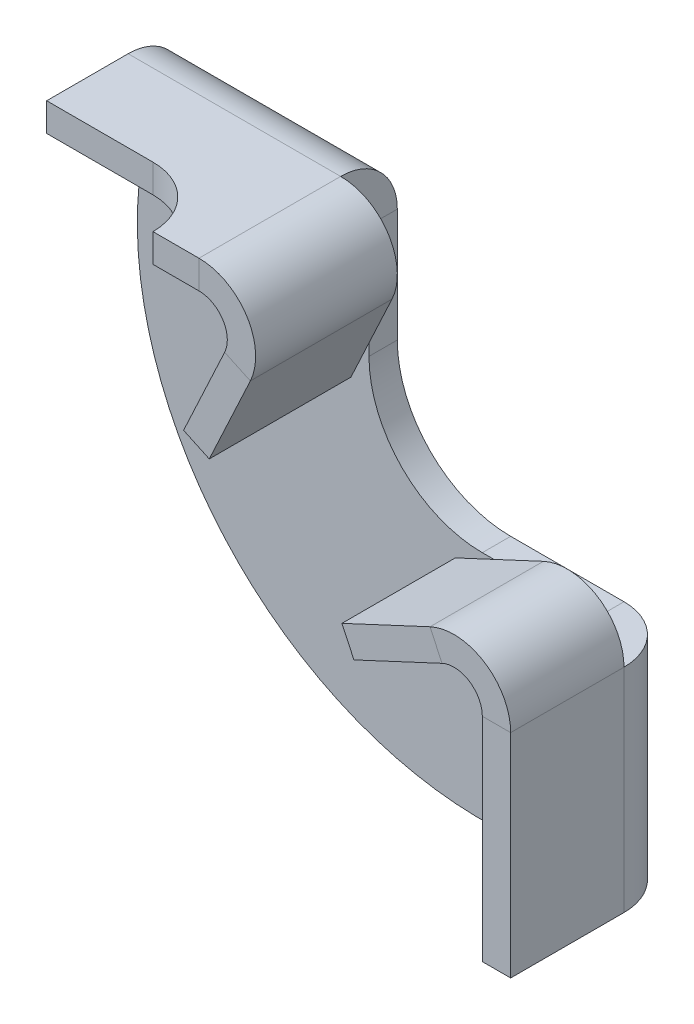
ISO-10303-21;
HEADER;
FILE_DESCRIPTION(('STEP AP214'),'2;1');
FILE_NAME('part.step','',(''),(''),'','','');
FILE_SCHEMA(('AUTOMOTIVE_DESIGN { 1 0 10303 214 1 1 1 1 }'));
ENDSEC;
DATA;
#1=APPLICATION_CONTEXT('core data for automotive mechanical design processes');
#2=APPLICATION_PROTOCOL_DEFINITION('international standard','automotive_design',2000,#1);
#3=PRODUCT_CONTEXT('',#1,'mechanical');
#4=PRODUCT('Part','Part','',(#3));
#5=PRODUCT_RELATED_PRODUCT_CATEGORY('part','',(#4));
#6=PRODUCT_DEFINITION_FORMATION('','',#4);
#7=PRODUCT_DEFINITION_CONTEXT('part definition',#1,'design');
#8=PRODUCT_DEFINITION('design','',#6,#7);
#9=PRODUCT_DEFINITION_SHAPE('','',#8);
#10=(LENGTH_UNIT() NAMED_UNIT(*) SI_UNIT(.MILLI.,.METRE.));
#11=(NAMED_UNIT(*) PLANE_ANGLE_UNIT() SI_UNIT($,.RADIAN.));
#12=(NAMED_UNIT(*) SI_UNIT($,.STERADIAN.) SOLID_ANGLE_UNIT());
#13=UNCERTAINTY_MEASURE_WITH_UNIT(LENGTH_MEASURE(1.E-05),#10,'distance_accuracy_value','');
#14=(GEOMETRIC_REPRESENTATION_CONTEXT(3) GLOBAL_UNCERTAINTY_ASSIGNED_CONTEXT((#13)) GLOBAL_UNIT_ASSIGNED_CONTEXT((#10,
#11,#12)) REPRESENTATION_CONTEXT('',''));
#15=CARTESIAN_POINT('',(0.,0.,0.));
#16=DIRECTION('',(0.,0.,1.));
#17=DIRECTION('',(1.,0.,0.));
#18=AXIS2_PLACEMENT_3D('',#15,#16,#17);
#19=CARTESIAN_POINT('',(-23.,11.9999999999999,1.99999999999999));
#20=DIRECTION('',(-1.,0.,0.));
#21=DIRECTION('',(0.,-1.,0.));
#22=AXIS2_PLACEMENT_3D('',#19,#20,#21);
#23=PLANE('',#22);
#24=DIRECTION('',(0.,0.,1.));
#25=VECTOR('',#24,1.);
#26=CARTESIAN_POINT('',(-23.,9.99999999999991,0.));
#27=LINE('',#26,#25);
#28=CARTESIAN_POINT('',(-23.,9.99999999999994,9.75000000000006));
#29=VERTEX_POINT('',#28);
#30=CARTESIAN_POINT('',(-23.,9.99999999999993,3.99999999999999));
#31=VERTEX_POINT('',#30);
#32=EDGE_CURVE('E1033',#29,#31,#27,.F.);
#33=ORIENTED_EDGE('',*,*,#32,.F.);
#34=DIRECTION('',(0.,1.,0.));
#35=VECTOR('',#34,1.);
#36=CARTESIAN_POINT('',(-23.,11.9999999999999,9.75000000000005));
#37=LINE('',#36,#35);
#38=CARTESIAN_POINT('',(-23.,11.9999999999999,9.75000000000005));
#39=VERTEX_POINT('',#38);
#40=EDGE_CURVE('E974',#39,#29,#37,.F.);
#41=ORIENTED_EDGE('',*,*,#40,.F.);
#42=DIRECTION('',(0.,0.,-1.));
#43=VECTOR('',#42,1.);
#44=CARTESIAN_POINT('',(-23.,11.9999999999999,1.99999999999999));
#45=LINE('',#44,#43);
#46=CARTESIAN_POINT('',(-23.,11.9999999999999,3.99999999999999));
#47=VERTEX_POINT('',#46);
#48=EDGE_CURVE('E393',#39,#47,#45,.T.);
#49=ORIENTED_EDGE('',*,*,#48,.T.);
#50=DIRECTION('',(0.,1.,0.));
#51=VECTOR('',#50,1.);
#52=CARTESIAN_POINT('',(-23.,9.99999999999992,3.99999999999999));
#53=LINE('',#52,#51);
#54=EDGE_CURVE('E376',#31,#47,#53,.T.);
#55=ORIENTED_EDGE('',*,*,#54,.F.);
#56=EDGE_LOOP('',(#33,#41,#49,#55));
#57=FACE_BOUND('',#56,.T.);
#58=ADVANCED_FACE('F125',(#57),#23,.T.);
#59=CARTESIAN_POINT('',(-23.,12.,14.0000000000001));
#60=DIRECTION('',(0.,0.,1.));
#61=DIRECTION('',(0.,-1.,0.));
#62=AXIS2_PLACEMENT_3D('',#59,#60,#61);
#63=PLANE('',#62);
#64=DIRECTION('',(-1.,0.,0.));
#65=VECTOR('',#64,1.);
#66=CARTESIAN_POINT('',(-23.,12.,14.0000000000001));
#67=LINE('',#66,#65);
#68=CARTESIAN_POINT('',(-8.00000000000001,12.,14.0000000000001));
#69=VERTEX_POINT('',#68);
#70=CARTESIAN_POINT('',(-11.25,12.,14.0000000000001));
#71=VERTEX_POINT('',#70);
#72=EDGE_CURVE('E1030',#69,#71,#67,.T.);
#73=ORIENTED_EDGE('',*,*,#72,.T.);
#74=DIRECTION('',(0.,1.,0.));
#75=VECTOR('',#74,1.);
#76=CARTESIAN_POINT('',(-11.25,12.,14.0000000000001));
#77=LINE('',#76,#75);
#78=CARTESIAN_POINT('',(-11.25,10.,14.0000000000001));
#79=VERTEX_POINT('',#78);
#80=EDGE_CURVE('E962',#71,#79,#77,.F.);
#81=ORIENTED_EDGE('',*,*,#80,.T.);
#82=DIRECTION('',(1.,0.,0.));
#83=VECTOR('',#82,1.);
#84=CARTESIAN_POINT('',(0.,10.,14.0000000000001));
#85=LINE('',#84,#83);
#86=CARTESIAN_POINT('',(-8.00000000000001,10.,14.0000000000001));
#87=VERTEX_POINT('',#86);
#88=EDGE_CURVE('E400',#87,#79,#85,.F.);
#89=ORIENTED_EDGE('',*,*,#88,.F.);
#90=DIRECTION('',(0.,-1.,0.));
#91=VECTOR('',#90,1.);
#92=CARTESIAN_POINT('',(-8.00000000000002,12.,14.0000000000001));
#93=LINE('',#92,#91);
#94=EDGE_CURVE('E232',#69,#87,#93,.T.);
#95=ORIENTED_EDGE('',*,*,#94,.F.);
#96=EDGE_LOOP('',(#73,#81,#89,#95));
#97=FACE_BOUND('',#96,.T.);
#98=ADVANCED_FACE('F519',(#97),#63,.T.);
#99=CARTESIAN_POINT('',(8.,-7.99999999999997,2.));
#100=DIRECTION('',(0.,-1.,0.));
#101=DIRECTION('',(1.,0.,0.));
#102=AXIS2_PLACEMENT_3D('',#99,#100,#101);
#103=PLANE('',#102);
#104=DIRECTION('',(-1.,0.,0.));
#105=VECTOR('',#104,1.);
#106=CARTESIAN_POINT('',(8.,-7.99999999999997,0.));
#107=LINE('',#106,#105);
#108=CARTESIAN_POINT('',(8.,-7.99999999999997,0.));
#109=VERTEX_POINT('',#108);
#110=CARTESIAN_POINT('',(0.,-7.99999999999999,0.));
#111=VERTEX_POINT('',#110);
#112=EDGE_CURVE('E342',#109,#111,#107,.T.);
#113=ORIENTED_EDGE('',*,*,#112,.T.);
#114=DIRECTION('',(0.,0.,-1.));
#115=VECTOR('',#114,1.);
#116=CARTESIAN_POINT('',(0.,-7.99999999999999,2.));
#117=LINE('',#116,#115);
#118=CARTESIAN_POINT('',(0.,-7.99999999999999,2.));
#119=VERTEX_POINT('',#118);
#120=EDGE_CURVE('E133',#119,#111,#117,.T.);
#121=ORIENTED_EDGE('',*,*,#120,.F.);
#122=DIRECTION('',(-1.,0.,0.));
#123=VECTOR('',#122,1.);
#124=CARTESIAN_POINT('',(8.,-7.99999999999997,2.));
#125=LINE('',#124,#123);
#126=CARTESIAN_POINT('',(8.,-7.99999999999997,2.));
#127=VERTEX_POINT('',#126);
#128=EDGE_CURVE('E178',#127,#119,#125,.T.);
#129=ORIENTED_EDGE('',*,*,#128,.F.);
#130=DIRECTION('',(0.,0.,-1.));
#131=VECTOR('',#130,1.);
#132=CARTESIAN_POINT('',(8.,-7.99999999999997,2.));
#133=LINE('',#132,#131);
#134=EDGE_CURVE('E13',#127,#109,#133,.T.);
#135=ORIENTED_EDGE('',*,*,#134,.T.);
#136=EDGE_LOOP('',(#113,#121,#129,#135));
#137=FACE_BOUND('',#136,.T.);
#138=ADVANCED_FACE('F127',(#137),#103,.F.);
#139=CARTESIAN_POINT('',(0.,0.,2.));
#140=DIRECTION('',(0.,0.,-1.));
#141=DIRECTION('',(-1.,0.,0.));
#142=AXIS2_PLACEMENT_3D('',#139,#140,#141);
#143=CYLINDRICAL_SURFACE('',#142,8.);
#144=CARTESIAN_POINT('',(0.,0.,0.));
#145=DIRECTION('',(0.,0.,-1.));
#146=DIRECTION('',(-1.,0.,0.));
#147=AXIS2_PLACEMENT_3D('',#144,#145,#146);
#148=CIRCLE('',#147,8.);
#149=CARTESIAN_POINT('',(-8.,0.,0.));
#150=VERTEX_POINT('',#149);
#151=EDGE_CURVE('E344',#111,#150,#148,.T.);
#152=ORIENTED_EDGE('',*,*,#151,.T.);
#153=DIRECTION('',(0.,0.,-1.));
#154=VECTOR('',#153,1.);
#155=CARTESIAN_POINT('',(-8.,0.,2.));
#156=LINE('',#155,#154);
#157=CARTESIAN_POINT('',(-8.,0.,2.));
#158=VERTEX_POINT('',#157);
#159=EDGE_CURVE('E209',#158,#150,#156,.T.);
#160=ORIENTED_EDGE('',*,*,#159,.F.);
#161=CARTESIAN_POINT('',(0.,0.,2.));
#162=DIRECTION('',(0.,0.,-1.));
#163=DIRECTION('',(-1.,0.,0.));
#164=AXIS2_PLACEMENT_3D('',#161,#162,#163);
#165=CIRCLE('',#164,8.);
#166=EDGE_CURVE('E194',#119,#158,#165,.T.);
#167=ORIENTED_EDGE('',*,*,#166,.F.);
#168=ORIENTED_EDGE('',*,*,#120,.T.);
#169=EDGE_LOOP('',(#152,#160,#167,#168));
#170=FACE_BOUND('',#169,.T.);
#171=ADVANCED_FACE('F358',(#170),#143,.F.);
#172=CARTESIAN_POINT('',(-8.,0.,2.));
#173=DIRECTION('',(-1.,0.,0.));
#174=DIRECTION('',(0.,0.,1.));
#175=AXIS2_PLACEMENT_3D('',#172,#173,#174);
#176=PLANE('',#175);
#177=DIRECTION('',(0.,1.,0.));
#178=VECTOR('',#177,1.);
#179=CARTESIAN_POINT('',(-8.,0.,0.));
#180=LINE('',#179,#178);
#181=CARTESIAN_POINT('',(-8.,7.99999999999998,0.));
#182=VERTEX_POINT('',#181);
#183=EDGE_CURVE('E203',#150,#182,#180,.T.);
#184=ORIENTED_EDGE('',*,*,#183,.T.);
#185=DIRECTION('',(0.,0.,-1.));
#186=VECTOR('',#185,1.);
#187=CARTESIAN_POINT('',(-8.,7.99999999999998,2.));
#188=LINE('',#187,#186);
#189=CARTESIAN_POINT('',(-8.,7.99999999999998,2.));
#190=VERTEX_POINT('',#189);
#191=EDGE_CURVE('E200',#190,#182,#188,.T.);
#192=ORIENTED_EDGE('',*,*,#191,.F.);
#193=DIRECTION('',(0.,1.,0.));
#194=VECTOR('',#193,1.);
#195=CARTESIAN_POINT('',(-8.,0.,2.));
#196=LINE('',#195,#194);
#197=EDGE_CURVE('E188',#158,#190,#196,.T.);
#198=ORIENTED_EDGE('',*,*,#197,.F.);
#199=ORIENTED_EDGE('',*,*,#159,.T.);
#200=EDGE_LOOP('',(#184,#192,#198,#199));
#201=FACE_BOUND('',#200,.T.);
#202=ADVANCED_FACE('F201',(#201),#176,.F.);
#203=CARTESIAN_POINT('',(0.,0.,2.));
#204=DIRECTION('',(0.,0.,-1.));
#205=DIRECTION('',(-1.,0.,0.));
#206=AXIS2_PLACEMENT_3D('',#203,#204,#205);
#207=CYLINDRICAL_SURFACE('',#206,24.3515913237718);
#208=CARTESIAN_POINT('',(0.,0.,0.));
#209=DIRECTION('',(0.,0.,1.));
#210=DIRECTION('',(1.,0.,0.));
#211=AXIS2_PLACEMENT_3D('',#208,#209,#210);
#212=CIRCLE('',#211,24.3515913237718);
#213=CARTESIAN_POINT('',(-23.,7.99999999999992,0.));
#214=VERTEX_POINT('',#213);
#215=CARTESIAN_POINT('',(8.,-23.,0.));
#216=VERTEX_POINT('',#215);
#217=EDGE_CURVE('E170',#214,#216,#212,.T.);
#218=ORIENTED_EDGE('',*,*,#217,.T.);
#219=DIRECTION('',(0.,0.,-1.));
#220=VECTOR('',#219,1.);
#221=CARTESIAN_POINT('',(8.,-23.,2.));
#222=LINE('',#221,#220);
#223=CARTESIAN_POINT('',(8.,-23.,2.));
#224=VERTEX_POINT('',#223);
#225=EDGE_CURVE('E339',#224,#216,#222,.T.);
#226=ORIENTED_EDGE('',*,*,#225,.F.);
#227=CARTESIAN_POINT('',(0.,0.,2.));
#228=DIRECTION('',(0.,0.,1.));
#229=DIRECTION('',(1.,0.,0.));
#230=AXIS2_PLACEMENT_3D('',#227,#228,#229);
#231=CIRCLE('',#230,24.3515913237718);
#232=CARTESIAN_POINT('',(-23.,7.99999999999992,2.));
#233=VERTEX_POINT('',#232);
#234=EDGE_CURVE('E149',#233,#224,#231,.T.);
#235=ORIENTED_EDGE('',*,*,#234,.F.);
#236=DIRECTION('',(0.,0.,-1.));
#237=VECTOR('',#236,1.);
#238=CARTESIAN_POINT('',(-23.,7.99999999999992,2.));
#239=LINE('',#238,#237);
#240=EDGE_CURVE('E210',#233,#214,#239,.T.);
#241=ORIENTED_EDGE('',*,*,#240,.T.);
#242=EDGE_LOOP('',(#218,#226,#235,#241));
#243=FACE_BOUND('',#242,.T.);
#244=ADVANCED_FACE('F904',(#243),#207,.T.);
#245=CARTESIAN_POINT('',(0.,0.,2.));
#246=DIRECTION('',(0.,0.,-1.));
#247=DIRECTION('',(-1.,0.,0.));
#248=AXIS2_PLACEMENT_3D('',#245,#246,#247);
#249=PLANE('',#248);
#250=DIRECTION('',(0.,1.,0.));
#251=VECTOR('',#250,1.);
#252=CARTESIAN_POINT('',(8.,-23.,2.));
#253=LINE('',#252,#251);
#254=EDGE_CURVE('E333',#224,#127,#253,.T.);
#255=ORIENTED_EDGE('',*,*,#254,.T.);
#256=ORIENTED_EDGE('',*,*,#128,.T.);
#257=ORIENTED_EDGE('',*,*,#166,.T.);
#258=ORIENTED_EDGE('',*,*,#197,.T.);
#259=DIRECTION('',(-1.,0.,0.));
#260=VECTOR('',#259,1.);
#261=CARTESIAN_POINT('',(-23.,7.99999999999992,2.));
#262=LINE('',#261,#260);
#263=EDGE_CURVE('E192',#190,#233,#262,.T.);
#264=ORIENTED_EDGE('',*,*,#263,.T.);
#265=ORIENTED_EDGE('',*,*,#234,.T.);
#266=EDGE_LOOP('',(#255,#256,#257,#258,#264,#265));
#267=FACE_BOUND('',#266,.T.);
#268=ADVANCED_FACE('F190',(#267),#249,.F.);
#269=CARTESIAN_POINT('',(0.,0.,0.));
#270=DIRECTION('',(0.,0.,-1.));
#271=DIRECTION('',(-1.,0.,0.));
#272=AXIS2_PLACEMENT_3D('',#269,#270,#271);
#273=PLANE('',#272);
#274=DIRECTION('',(0.,1.,0.));
#275=VECTOR('',#274,1.);
#276=CARTESIAN_POINT('',(8.,-23.,0.));
#277=LINE('',#276,#275);
#278=EDGE_CURVE('E324',#216,#109,#277,.T.);
#279=ORIENTED_EDGE('',*,*,#278,.F.);
#280=ORIENTED_EDGE('',*,*,#217,.F.);
#281=DIRECTION('',(-1.,0.,0.));
#282=VECTOR('',#281,1.);
#283=CARTESIAN_POINT('',(-23.,7.99999999999992,0.));
#284=LINE('',#283,#282);
#285=EDGE_CURVE('E347',#182,#214,#284,.T.);
#286=ORIENTED_EDGE('',*,*,#285,.F.);
#287=ORIENTED_EDGE('',*,*,#183,.F.);
#288=ORIENTED_EDGE('',*,*,#151,.F.);
#289=ORIENTED_EDGE('',*,*,#112,.F.);
#290=EDGE_LOOP('',(#279,#280,#286,#287,#288,#289));
#291=FACE_BOUND('',#290,.T.);
#292=ADVANCED_FACE('F361',(#291),#273,.T.);
#293=CARTESIAN_POINT('',(8.,-23.,4.));
#294=DIRECTION('',(0.,-1.,0.));
#295=DIRECTION('',(0.,0.,-1.));
#296=AXIS2_PLACEMENT_3D('',#293,#294,#295);
#297=PLANE('',#296);
#298=DIRECTION('',(1.,0.,0.));
#299=VECTOR('',#298,1.);
#300=CARTESIAN_POINT('',(12.,-23.,3.99999999999999));
#301=LINE('',#300,#299);
#302=CARTESIAN_POINT('',(10.,-23.,3.99999999999999));
#303=VERTEX_POINT('',#302);
#304=CARTESIAN_POINT('',(12.,-23.,3.99999999999999));
#305=VERTEX_POINT('',#304);
#306=EDGE_CURVE('E276',#303,#305,#301,.T.);
#307=ORIENTED_EDGE('',*,*,#306,.F.);
#308=CARTESIAN_POINT('',(8.,-23.,4.));
#309=DIRECTION('',(0.,1.,0.));
#310=DIRECTION('',(0.,0.,1.));
#311=AXIS2_PLACEMENT_3D('',#308,#309,#310);
#312=CIRCLE('',#311,2.);
#313=EDGE_CURVE('E328',#224,#303,#312,.F.);
#314=ORIENTED_EDGE('',*,*,#313,.F.);
#315=ORIENTED_EDGE('',*,*,#225,.T.);
#316=CARTESIAN_POINT('',(8.,-23.,4.));
#317=DIRECTION('',(0.,1.,0.));
#318=DIRECTION('',(0.,0.,1.));
#319=AXIS2_PLACEMENT_3D('',#316,#317,#318);
#320=CIRCLE('',#319,4.);
#321=EDGE_CURVE('E321',#216,#305,#320,.F.);
#322=ORIENTED_EDGE('',*,*,#321,.T.);
#323=EDGE_LOOP('',(#307,#314,#315,#322));
#324=FACE_BOUND('',#323,.T.);
#325=ADVANCED_FACE('F505',(#324),#297,.T.);
#326=CARTESIAN_POINT('',(8.,-7.99999999999997,4.));
#327=DIRECTION('',(0.,-1.,0.));
#328=DIRECTION('',(0.,0.,-1.));
#329=AXIS2_PLACEMENT_3D('',#326,#327,#328);
#330=PLANE('',#329);
#331=CARTESIAN_POINT('',(8.,-7.99999999999997,4.));
#332=DIRECTION('',(0.,1.,0.));
#333=DIRECTION('',(0.,0.,1.));
#334=AXIS2_PLACEMENT_3D('',#331,#332,#333);
#335=CIRCLE('',#334,2.);
#336=CARTESIAN_POINT('',(10.,-7.99999999999997,3.99999999999999));
#337=VERTEX_POINT('',#336);
#338=EDGE_CURVE('E288',#337,#127,#335,.T.);
#339=ORIENTED_EDGE('',*,*,#338,.F.);
#340=DIRECTION('',(1.,0.,0.));
#341=VECTOR('',#340,1.);
#342=CARTESIAN_POINT('',(10.,-7.99999999999997,3.99999999999999));
#343=LINE('',#342,#341);
#344=CARTESIAN_POINT('',(12.,-7.99999999999997,3.99999999999999));
#345=VERTEX_POINT('',#344);
#346=EDGE_CURVE('E313',#337,#345,#343,.T.);
#347=ORIENTED_EDGE('',*,*,#346,.T.);
#348=CARTESIAN_POINT('',(8.,-7.99999999999997,4.));
#349=DIRECTION('',(0.,1.,0.));
#350=DIRECTION('',(0.,0.,1.));
#351=AXIS2_PLACEMENT_3D('',#348,#349,#350);
#352=CIRCLE('',#351,4.);
#353=EDGE_CURVE('E325',#345,#109,#352,.T.);
#354=ORIENTED_EDGE('',*,*,#353,.T.);
#355=ORIENTED_EDGE('',*,*,#134,.F.);
#356=EDGE_LOOP('',(#339,#347,#354,#355));
#357=FACE_BOUND('',#356,.T.);
#358=ADVANCED_FACE('F456',(#357),#330,.F.);
#359=CARTESIAN_POINT('',(8.,-7.99999999999997,4.));
#360=DIRECTION('',(0.,1.,0.));
#361=DIRECTION('',(1.,0.,0.));
#362=AXIS2_PLACEMENT_3D('',#359,#360,#361);
#363=CYLINDRICAL_SURFACE('',#362,4.);
#364=ORIENTED_EDGE('',*,*,#278,.T.);
#365=ORIENTED_EDGE('',*,*,#353,.F.);
#366=DIRECTION('',(0.,1.,0.));
#367=VECTOR('',#366,1.);
#368=CARTESIAN_POINT('',(12.,0.,3.99999999999999));
#369=LINE('',#368,#367);
#370=EDGE_CURVE('E310',#305,#345,#369,.T.);
#371=ORIENTED_EDGE('',*,*,#370,.F.);
#372=ORIENTED_EDGE('',*,*,#321,.F.);
#373=EDGE_LOOP('',(#364,#365,#371,#372));
#374=FACE_BOUND('',#373,.T.);
#375=ADVANCED_FACE('F504',(#374),#363,.T.);
#376=CARTESIAN_POINT('',(8.,-7.99999999999997,4.));
#377=DIRECTION('',(0.,1.,0.));
#378=DIRECTION('',(1.,0.,0.));
#379=AXIS2_PLACEMENT_3D('',#376,#377,#378);
#380=CYLINDRICAL_SURFACE('',#379,2.);
#381=ORIENTED_EDGE('',*,*,#254,.F.);
#382=ORIENTED_EDGE('',*,*,#313,.T.);
#383=DIRECTION('',(0.,-1.,0.));
#384=VECTOR('',#383,1.);
#385=CARTESIAN_POINT('',(10.,-23.,3.99999999999999));
#386=LINE('',#385,#384);
#387=EDGE_CURVE('E316',#303,#337,#386,.F.);
#388=ORIENTED_EDGE('',*,*,#387,.T.);
#389=ORIENTED_EDGE('',*,*,#338,.T.);
#390=EDGE_LOOP('',(#381,#382,#388,#389));
#391=FACE_BOUND('',#390,.T.);
#392=ADVANCED_FACE('F451',(#391),#380,.F.);
#393=CARTESIAN_POINT('',(12.,-23.,12.));
#394=DIRECTION('',(0.,-1.,0.));
#395=DIRECTION('',(1.,0.,0.));
#396=AXIS2_PLACEMENT_3D('',#393,#394,#395);
#397=PLANE('',#396);
#398=DIRECTION('',(0.,0.,-1.));
#399=VECTOR('',#398,1.);
#400=CARTESIAN_POINT('',(9.99999999999999,-23.,0.));
#401=LINE('',#400,#399);
#402=CARTESIAN_POINT('',(10.,-23.,12.));
#403=VERTEX_POINT('',#402);
#404=EDGE_CURVE('E307',#303,#403,#401,.F.);
#405=ORIENTED_EDGE('',*,*,#404,.F.);
#406=ORIENTED_EDGE('',*,*,#306,.T.);
#407=DIRECTION('',(0.,0.,1.));
#408=VECTOR('',#407,1.);
#409=CARTESIAN_POINT('',(12.,-23.,12.));
#410=LINE('',#409,#408);
#411=CARTESIAN_POINT('',(12.,-23.,12.));
#412=VERTEX_POINT('',#411);
#413=EDGE_CURVE('E298',#305,#412,#410,.T.);
#414=ORIENTED_EDGE('',*,*,#413,.T.);
#415=DIRECTION('',(-1.,0.,0.));
#416=VECTOR('',#415,1.);
#417=CARTESIAN_POINT('',(12.,-23.,12.));
#418=LINE('',#417,#416);
#419=EDGE_CURVE('E289',#412,#403,#418,.T.);
#420=ORIENTED_EDGE('',*,*,#419,.T.);
#421=EDGE_LOOP('',(#405,#406,#414,#420));
#422=FACE_BOUND('',#421,.T.);
#423=ADVANCED_FACE('F507',(#422),#397,.T.);
#424=CARTESIAN_POINT('',(12.,0.,0.));
#425=DIRECTION('',(1.,0.,0.));
#426=DIRECTION('',(0.,0.,-1.));
#427=AXIS2_PLACEMENT_3D('',#424,#425,#426);
#428=PLANE('',#427);
#429=ORIENTED_EDGE('',*,*,#413,.F.);
#430=ORIENTED_EDGE('',*,*,#370,.T.);
#431=DIRECTION('',(0.,0.,-1.));
#432=VECTOR('',#431,1.);
#433=CARTESIAN_POINT('',(12.,-7.99999999999997,1.99999999999999));
#434=LINE('',#433,#432);
#435=CARTESIAN_POINT('',(12.,-7.99999999999997,12.));
#436=VERTEX_POINT('',#435);
#437=EDGE_CURVE('E292',#436,#345,#434,.T.);
#438=ORIENTED_EDGE('',*,*,#437,.F.);
#439=DIRECTION('',(0.,1.,0.));
#440=VECTOR('',#439,1.);
#441=CARTESIAN_POINT('',(12.,-7.99999999999997,12.));
#442=LINE('',#441,#440);
#443=EDGE_CURVE('E295',#412,#436,#442,.T.);
#444=ORIENTED_EDGE('',*,*,#443,.F.);
#445=EDGE_LOOP('',(#429,#430,#438,#444));
#446=FACE_BOUND('',#445,.T.);
#447=ADVANCED_FACE('F501',(#446),#428,.T.);
#448=CARTESIAN_POINT('',(9.99999999999998,0.,0.));
#449=DIRECTION('',(1.,0.,0.));
#450=DIRECTION('',(0.,0.,-1.));
#451=AXIS2_PLACEMENT_3D('',#448,#449,#450);
#452=PLANE('',#451);
#453=ORIENTED_EDGE('',*,*,#387,.F.);
#454=ORIENTED_EDGE('',*,*,#404,.T.);
#455=DIRECTION('',(0.,-1.,0.));
#456=VECTOR('',#455,1.);
#457=CARTESIAN_POINT('',(10.,0.,12.));
#458=LINE('',#457,#456);
#459=CARTESIAN_POINT('',(10.,-7.99999999999997,12.));
#460=VERTEX_POINT('',#459);
#461=EDGE_CURVE('E304',#403,#460,#458,.F.);
#462=ORIENTED_EDGE('',*,*,#461,.T.);
#463=DIRECTION('',(0.,0.,1.));
#464=VECTOR('',#463,1.);
#465=CARTESIAN_POINT('',(9.99999999999999,-7.99999999999997,0.));
#466=LINE('',#465,#464);
#467=EDGE_CURVE('E301',#460,#337,#466,.F.);
#468=ORIENTED_EDGE('',*,*,#467,.T.);
#469=EDGE_LOOP('',(#453,#454,#462,#468));
#470=FACE_BOUND('',#469,.T.);
#471=ADVANCED_FACE('F460',(#470),#452,.F.);
#472=CARTESIAN_POINT('',(12.,-7.99999999999997,12.));
#473=DIRECTION('',(0.,0.,1.));
#474=DIRECTION('',(1.,0.,0.));
#475=AXIS2_PLACEMENT_3D('',#472,#473,#474);
#476=PLANE('',#475);
#477=ORIENTED_EDGE('',*,*,#461,.F.);
#478=ORIENTED_EDGE('',*,*,#419,.F.);
#479=ORIENTED_EDGE('',*,*,#443,.T.);
#480=DIRECTION('',(-1.,0.,0.));
#481=VECTOR('',#480,1.);
#482=CARTESIAN_POINT('',(12.,-7.99999999999997,12.));
#483=LINE('',#482,#481);
#484=EDGE_CURVE('E285',#436,#460,#483,.T.);
#485=ORIENTED_EDGE('',*,*,#484,.T.);
#486=EDGE_LOOP('',(#477,#478,#479,#485));
#487=FACE_BOUND('',#486,.T.);
#488=ADVANCED_FACE('F495',(#487),#476,.T.);
#489=CARTESIAN_POINT('',(8.00000000000003,-7.99999999999997,12.));
#490=DIRECTION('',(0.,0.,1.));
#491=DIRECTION('',(1.,0.,0.));
#492=AXIS2_PLACEMENT_3D('',#489,#490,#491);
#493=PLANE('',#492);
#494=DIRECTION('',(0.422618261740697,-0.906307787036651,0.));
#495=VECTOR('',#494,1.);
#496=CARTESIAN_POINT('',(6.30952695303724,-4.37476885185336,12.));
#497=LINE('',#496,#495);
#498=CARTESIAN_POINT('',(7.15476347651864,-6.18738442592666,12.));
#499=VERTEX_POINT('',#498);
#500=CARTESIAN_POINT('',(6.30952695303724,-4.37476885185336,12.));
#501=VERTEX_POINT('',#500);
#502=EDGE_CURVE('E270',#499,#501,#497,.F.);
#503=ORIENTED_EDGE('',*,*,#502,.F.);
#504=CARTESIAN_POINT('',(8.00000000000003,-7.99999999999997,12.));
#505=DIRECTION('',(0.,0.,-1.));
#506=DIRECTION('',(-1.,0.,0.));
#507=AXIS2_PLACEMENT_3D('',#504,#505,#506);
#508=CIRCLE('',#507,2.);
#509=EDGE_CURVE('E280',#460,#499,#508,.F.);
#510=ORIENTED_EDGE('',*,*,#509,.F.);
#511=ORIENTED_EDGE('',*,*,#484,.F.);
#512=CARTESIAN_POINT('',(8.00000000000003,-7.99999999999997,12.));
#513=DIRECTION('',(0.,0.,-1.));
#514=DIRECTION('',(-1.,0.,0.));
#515=AXIS2_PLACEMENT_3D('',#512,#513,#514);
#516=CIRCLE('',#515,4.);
#517=EDGE_CURVE('E273',#436,#501,#516,.F.);
#518=ORIENTED_EDGE('',*,*,#517,.T.);
#519=EDGE_LOOP('',(#503,#510,#511,#518));
#520=FACE_BOUND('',#519,.T.);
#521=ADVANCED_FACE('F493',(#520),#493,.T.);
#522=CARTESIAN_POINT('',(8.,-7.99999999999997,4.));
#523=DIRECTION('',(0.,0.,1.));
#524=DIRECTION('',(1.,0.,0.));
#525=AXIS2_PLACEMENT_3D('',#522,#523,#524);
#526=PLANE('',#525);
#527=CARTESIAN_POINT('',(8.,-7.99999999999997,4.));
#528=DIRECTION('',(0.,0.,-1.));
#529=DIRECTION('',(-1.,0.,0.));
#530=AXIS2_PLACEMENT_3D('',#527,#528,#529);
#531=CIRCLE('',#530,2.);
#532=CARTESIAN_POINT('',(7.15476347651861,-6.18738442592666,4.));
#533=VERTEX_POINT('',#532);
#534=EDGE_CURVE('E239',#533,#337,#531,.T.);
#535=ORIENTED_EDGE('',*,*,#534,.F.);
#536=DIRECTION('',(0.422618261740697,-0.906307787036651,0.));
#537=VECTOR('',#536,1.);
#538=CARTESIAN_POINT('',(7.15476347651861,-6.18738442592666,4.));
#539=LINE('',#538,#537);
#540=CARTESIAN_POINT('',(6.30952695303721,-4.37476885185336,4.));
#541=VERTEX_POINT('',#540);
#542=EDGE_CURVE('E264',#533,#541,#539,.F.);
#543=ORIENTED_EDGE('',*,*,#542,.T.);
#544=CARTESIAN_POINT('',(8.,-7.99999999999997,4.));
#545=DIRECTION('',(0.,0.,-1.));
#546=DIRECTION('',(-1.,0.,0.));
#547=AXIS2_PLACEMENT_3D('',#544,#545,#546);
#548=CIRCLE('',#547,4.);
#549=EDGE_CURVE('E277',#541,#345,#548,.T.);
#550=ORIENTED_EDGE('',*,*,#549,.T.);
#551=ORIENTED_EDGE('',*,*,#346,.F.);
#552=EDGE_LOOP('',(#535,#543,#550,#551));
#553=FACE_BOUND('',#552,.T.);
#554=ADVANCED_FACE('F466',(#553),#526,.F.);
#555=CARTESIAN_POINT('',(8.,-7.99999999999997,4.));
#556=DIRECTION('',(0.,0.,-1.));
#557=DIRECTION('',(-0.422618261740697,0.906307787036651,0.));
#558=AXIS2_PLACEMENT_3D('',#555,#556,#557);
#559=CYLINDRICAL_SURFACE('',#558,4.);
#560=ORIENTED_EDGE('',*,*,#437,.T.);
#561=ORIENTED_EDGE('',*,*,#549,.F.);
#562=DIRECTION('',(0.,0.,-1.));
#563=VECTOR('',#562,1.);
#564=CARTESIAN_POINT('',(6.3095269530372,-4.37476885185336,0.));
#565=LINE('',#564,#563);
#566=EDGE_CURVE('E261',#501,#541,#565,.T.);
#567=ORIENTED_EDGE('',*,*,#566,.F.);
#568=ORIENTED_EDGE('',*,*,#517,.F.);
#569=EDGE_LOOP('',(#560,#561,#567,#568));
#570=FACE_BOUND('',#569,.T.);
#571=ADVANCED_FACE('F490',(#570),#559,.T.);
#572=CARTESIAN_POINT('',(8.,-7.99999999999997,4.));
#573=DIRECTION('',(0.,0.,-1.));
#574=DIRECTION('',(-0.422618261740697,0.906307787036651,0.));
#575=AXIS2_PLACEMENT_3D('',#572,#573,#574);
#576=CYLINDRICAL_SURFACE('',#575,2.);
#577=ORIENTED_EDGE('',*,*,#467,.F.);
#578=ORIENTED_EDGE('',*,*,#509,.T.);
#579=DIRECTION('',(0.,0.,1.));
#580=VECTOR('',#579,1.);
#581=CARTESIAN_POINT('',(7.15476347651864,-6.18738442592666,12.));
#582=LINE('',#581,#580);
#583=EDGE_CURVE('E267',#499,#533,#582,.F.);
#584=ORIENTED_EDGE('',*,*,#583,.T.);
#585=ORIENTED_EDGE('',*,*,#534,.T.);
#586=EDGE_LOOP('',(#577,#578,#584,#585));
#587=FACE_BOUND('',#586,.T.);
#588=ADVANCED_FACE('F468',(#587),#576,.F.);
#589=CARTESIAN_POINT('',(9.15476347651861,-3.04801327169169,4.));
#590=DIRECTION('',(0.,0.,1.));
#591=DIRECTION('',(1.,0.,0.));
#592=AXIS2_PLACEMENT_3D('',#589,#590,#591);
#593=PLANE('',#592);
#594=ORIENTED_EDGE('',*,*,#542,.F.);
#595=DIRECTION('',(-0.906307787036651,-0.422618261740697,0.));
#596=VECTOR('',#595,1.);
#597=CARTESIAN_POINT('',(10.,-4.86062884576499,3.99999999999999));
#598=LINE('',#597,#596);
#599=CARTESIAN_POINT('',(0.936922129633493,-9.08681146317196,4.00000000000002));
#600=VERTEX_POINT('',#599);
#601=EDGE_CURVE('E258',#533,#600,#598,.T.);
#602=ORIENTED_EDGE('',*,*,#601,.T.);
#603=DIRECTION('',(0.422618261740697,-0.906307787036651,0.));
#604=VECTOR('',#603,1.);
#605=CARTESIAN_POINT('',(0.0916856061520983,-7.27419588909866,4.00000000000002));
#606=LINE('',#605,#604);
#607=CARTESIAN_POINT('',(0.0916856061520981,-7.27419588909866,4.00000000000002));
#608=VERTEX_POINT('',#607);
#609=EDGE_CURVE('E236',#608,#600,#606,.T.);
#610=ORIENTED_EDGE('',*,*,#609,.F.);
#611=DIRECTION('',(0.906307787036651,0.422618261740697,0.));
#612=VECTOR('',#611,1.);
#613=CARTESIAN_POINT('',(4.00500320056178,-5.44938592603274,4.00000000000001));
#614=LINE('',#613,#612);
#615=EDGE_CURVE('E249',#541,#608,#614,.F.);
#616=ORIENTED_EDGE('',*,*,#615,.F.);
#617=EDGE_LOOP('',(#594,#602,#610,#616));
#618=FACE_BOUND('',#617,.T.);
#619=ADVANCED_FACE('F485',(#618),#593,.F.);
#620=CARTESIAN_POINT('',(0.0916856061521226,-7.27419588909866,12.));
#621=DIRECTION('',(0.,0.,-1.));
#622=DIRECTION('',(-1.,0.,0.));
#623=AXIS2_PLACEMENT_3D('',#620,#621,#622);
#624=PLANE('',#623);
#625=ORIENTED_EDGE('',*,*,#502,.T.);
#626=DIRECTION('',(-0.906307787036651,-0.422618261740697,0.));
#627=VECTOR('',#626,1.);
#628=CARTESIAN_POINT('',(4.00500320056181,-5.44938592603274,12.));
#629=LINE('',#628,#627);
#630=CARTESIAN_POINT('',(0.0916856061521221,-7.27419588909866,12.));
#631=VERTEX_POINT('',#630);
#632=EDGE_CURVE('E243',#631,#501,#629,.F.);
#633=ORIENTED_EDGE('',*,*,#632,.F.);
#634=DIRECTION('',(0.422618261740697,-0.906307787036651,0.));
#635=VECTOR('',#634,1.);
#636=CARTESIAN_POINT('',(0.0916856061521226,-7.27419588909866,12.));
#637=LINE('',#636,#635);
#638=CARTESIAN_POINT('',(0.936922129633517,-9.08681146317197,12.));
#639=VERTEX_POINT('',#638);
#640=EDGE_CURVE('E240',#631,#639,#637,.T.);
#641=ORIENTED_EDGE('',*,*,#640,.T.);
#642=DIRECTION('',(0.906307787036651,0.422618261740697,0.));
#643=VECTOR('',#642,1.);
#644=CARTESIAN_POINT('',(0.936922129633517,-9.08681146317196,12.));
#645=LINE('',#644,#643);
#646=EDGE_CURVE('E252',#639,#499,#645,.T.);
#647=ORIENTED_EDGE('',*,*,#646,.T.);
#648=EDGE_LOOP('',(#625,#633,#641,#647));
#649=FACE_BOUND('',#648,.T.);
#650=ADVANCED_FACE('F476',(#649),#624,.F.);
#651=CARTESIAN_POINT('',(4.00500320056177,-5.44938592603274,0.));
#652=DIRECTION('',(-0.422618261740697,0.906307787036651,0.));
#653=DIRECTION('',(-0.906307787036651,-0.422618261740697,0.));
#654=AXIS2_PLACEMENT_3D('',#651,#652,#653);
#655=PLANE('',#654);
#656=ORIENTED_EDGE('',*,*,#632,.T.);
#657=ORIENTED_EDGE('',*,*,#566,.T.);
#658=ORIENTED_EDGE('',*,*,#615,.T.);
#659=DIRECTION('',(0.,0.,-1.));
#660=VECTOR('',#659,1.);
#661=CARTESIAN_POINT('',(0.0916856061520862,-7.27419588909866,0.));
#662=LINE('',#661,#660);
#663=EDGE_CURVE('E246',#608,#631,#662,.F.);
#664=ORIENTED_EDGE('',*,*,#663,.T.);
#665=EDGE_LOOP('',(#656,#657,#658,#664));
#666=FACE_BOUND('',#665,.T.);
#667=ADVANCED_FACE('F487',(#666),#655,.T.);
#668=CARTESIAN_POINT('',(4.85023972404317,-7.26200150010604,0.));
#669=DIRECTION('',(-0.422618261740697,0.906307787036651,0.));
#670=DIRECTION('',(-0.906307787036651,-0.422618261740697,0.));
#671=AXIS2_PLACEMENT_3D('',#668,#669,#670);
#672=PLANE('',#671);
#673=ORIENTED_EDGE('',*,*,#583,.F.);
#674=ORIENTED_EDGE('',*,*,#646,.F.);
#675=DIRECTION('',(0.,0.,1.));
#676=VECTOR('',#675,1.);
#677=CARTESIAN_POINT('',(0.936922129633493,-9.08681146317196,4.00000000000002));
#678=LINE('',#677,#676);
#679=EDGE_CURVE('E255',#600,#639,#678,.T.);
#680=ORIENTED_EDGE('',*,*,#679,.F.);
#681=ORIENTED_EDGE('',*,*,#601,.F.);
#682=EDGE_LOOP('',(#673,#674,#680,#681));
#683=FACE_BOUND('',#682,.T.);
#684=ADVANCED_FACE('F472',(#683),#672,.F.);
#685=CARTESIAN_POINT('',(0.0916856061520983,-7.27419588909866,4.00000000000002));
#686=DIRECTION('',(0.906307787036651,0.422618261740697,0.));
#687=DIRECTION('',(-0.422618261740697,0.906307787036651,0.));
#688=AXIS2_PLACEMENT_3D('',#685,#686,#687);
#689=PLANE('',#688);
#690=ORIENTED_EDGE('',*,*,#679,.T.);
#691=ORIENTED_EDGE('',*,*,#640,.F.);
#692=ORIENTED_EDGE('',*,*,#663,.F.);
#693=ORIENTED_EDGE('',*,*,#609,.T.);
#694=EDGE_LOOP('',(#690,#691,#692,#693));
#695=FACE_BOUND('',#694,.T.);
#696=ADVANCED_FACE('F481',(#695),#689,.F.);
#697=CARTESIAN_POINT('',(-8.,7.99999999999998,4.));
#698=DIRECTION('',(1.,0.,0.));
#699=DIRECTION('',(0.,1.,0.));
#700=AXIS2_PLACEMENT_3D('',#697,#698,#699);
#701=PLANE('',#700);
#702=DIRECTION('',(0.,1.,0.));
#703=VECTOR('',#702,1.);
#704=CARTESIAN_POINT('',(-8.00000000000001,12.,3.99999999999999));
#705=LINE('',#704,#703);
#706=CARTESIAN_POINT('',(-8.00000000000001,9.99999999999998,3.99999999999999));
#707=VERTEX_POINT('',#706);
#708=CARTESIAN_POINT('',(-8.00000000000001,12.,3.99999999999999));
#709=VERTEX_POINT('',#708);
#710=EDGE_CURVE('E226',#707,#709,#705,.T.);
#711=ORIENTED_EDGE('',*,*,#710,.F.);
#712=CARTESIAN_POINT('',(-8.,7.99999999999998,4.));
#713=DIRECTION('',(-1.,0.,0.));
#714=DIRECTION('',(0.,-1.,0.));
#715=AXIS2_PLACEMENT_3D('',#712,#713,#714);
#716=CIRCLE('',#715,2.);
#717=EDGE_CURVE('E218',#190,#707,#716,.F.);
#718=ORIENTED_EDGE('',*,*,#717,.F.);
#719=ORIENTED_EDGE('',*,*,#191,.T.);
#720=CARTESIAN_POINT('',(-8.,7.99999999999998,4.));
#721=DIRECTION('',(-1.,0.,0.));
#722=DIRECTION('',(0.,-1.,0.));
#723=AXIS2_PLACEMENT_3D('',#720,#721,#722);
#724=CIRCLE('',#723,4.);
#725=EDGE_CURVE('E230',#182,#709,#724,.F.);
#726=ORIENTED_EDGE('',*,*,#725,.T.);
#727=EDGE_LOOP('',(#711,#718,#719,#726));
#728=FACE_BOUND('',#727,.T.);
#729=ADVANCED_FACE('F224',(#728),#701,.T.);
#730=CARTESIAN_POINT('',(-23.,7.99999999999993,4.));
#731=DIRECTION('',(1.,0.,0.));
#732=DIRECTION('',(0.,1.,0.));
#733=AXIS2_PLACEMENT_3D('',#730,#731,#732);
#734=PLANE('',#733);
#735=CARTESIAN_POINT('',(-23.,7.99999999999993,4.));
#736=DIRECTION('',(-1.,0.,0.));
#737=DIRECTION('',(0.,-1.,0.));
#738=AXIS2_PLACEMENT_3D('',#735,#736,#737);
#739=CIRCLE('',#738,2.);
#740=EDGE_CURVE('E221',#31,#233,#739,.T.);
#741=ORIENTED_EDGE('',*,*,#740,.F.);
#742=ORIENTED_EDGE('',*,*,#54,.T.);
#743=CARTESIAN_POINT('',(-23.,7.99999999999993,4.));
#744=DIRECTION('',(-1.,0.,0.));
#745=DIRECTION('',(0.,-1.,0.));
#746=AXIS2_PLACEMENT_3D('',#743,#744,#745);
#747=CIRCLE('',#746,4.);
#748=EDGE_CURVE('E227',#47,#214,#747,.T.);
#749=ORIENTED_EDGE('',*,*,#748,.T.);
#750=ORIENTED_EDGE('',*,*,#240,.F.);
#751=EDGE_LOOP('',(#741,#742,#749,#750));
#752=FACE_BOUND('',#751,.T.);
#753=ADVANCED_FACE('F374',(#752),#734,.F.);
#754=CARTESIAN_POINT('',(-23.,7.99999999999993,4.));
#755=DIRECTION('',(-1.,0.,0.));
#756=DIRECTION('',(0.,1.,0.));
#757=AXIS2_PLACEMENT_3D('',#754,#755,#756);
#758=CYLINDRICAL_SURFACE('',#757,4.);
#759=ORIENTED_EDGE('',*,*,#285,.T.);
#760=ORIENTED_EDGE('',*,*,#748,.F.);
#761=DIRECTION('',(-1.,0.,0.));
#762=VECTOR('',#761,1.);
#763=CARTESIAN_POINT('',(0.,12.,3.99999999999999));
#764=LINE('',#763,#762);
#765=EDGE_CURVE('E384',#709,#47,#764,.T.);
#766=ORIENTED_EDGE('',*,*,#765,.F.);
#767=ORIENTED_EDGE('',*,*,#725,.F.);
#768=EDGE_LOOP('',(#759,#760,#766,#767));
#769=FACE_BOUND('',#768,.T.);
#770=ADVANCED_FACE('F365',(#769),#758,.T.);
#771=CARTESIAN_POINT('',(-23.,7.99999999999993,4.));
#772=DIRECTION('',(-1.,0.,0.));
#773=DIRECTION('',(0.,1.,0.));
#774=AXIS2_PLACEMENT_3D('',#771,#772,#773);
#775=CYLINDRICAL_SURFACE('',#774,2.);
#776=ORIENTED_EDGE('',*,*,#263,.F.);
#777=ORIENTED_EDGE('',*,*,#717,.T.);
#778=DIRECTION('',(1.,0.,0.));
#779=VECTOR('',#778,1.);
#780=CARTESIAN_POINT('',(-8.00000000000001,9.99999999999998,3.99999999999999));
#781=LINE('',#780,#779);
#782=EDGE_CURVE('E385',#707,#31,#781,.F.);
#783=ORIENTED_EDGE('',*,*,#782,.T.);
#784=ORIENTED_EDGE('',*,*,#740,.T.);
#785=EDGE_LOOP('',(#776,#777,#783,#784));
#786=FACE_BOUND('',#785,.T.);
#787=ADVANCED_FACE('F215',(#786),#775,.F.);
#788=CARTESIAN_POINT('',(0.,12.,0.));
#789=DIRECTION('',(0.,1.,0.));
#790=DIRECTION('',(-1.,0.,0.));
#791=AXIS2_PLACEMENT_3D('',#788,#789,#790);
#792=PLANE('',#791);
#793=ORIENTED_EDGE('',*,*,#48,.F.);
#794=DIRECTION('',(-1.,0.,0.));
#795=VECTOR('',#794,1.);
#796=CARTESIAN_POINT('',(0.,12.,9.75000000000006));
#797=LINE('',#796,#795);
#798=CARTESIAN_POINT('',(-15.5,12.,9.75000000000005));
#799=VERTEX_POINT('',#798);
#800=EDGE_CURVE('E965',#799,#39,#797,.T.);
#801=ORIENTED_EDGE('',*,*,#800,.F.);
#802=CARTESIAN_POINT('',(-15.5,12.,14.0000000000001));
#803=DIRECTION('',(0.,1.,0.));
#804=DIRECTION('',(-1.,0.,0.));
#805=AXIS2_PLACEMENT_3D('',#802,#803,#804);
#806=CIRCLE('',#805,4.25);
#807=EDGE_CURVE('E957',#71,#799,#806,.T.);
#808=ORIENTED_EDGE('',*,*,#807,.F.);
#809=ORIENTED_EDGE('',*,*,#72,.F.);
#810=DIRECTION('',(0.,0.,1.));
#811=VECTOR('',#810,1.);
#812=CARTESIAN_POINT('',(-8.00000000000002,12.,14.0000000000001));
#813=LINE('',#812,#811);
#814=EDGE_CURVE('E396',#709,#69,#813,.T.);
#815=ORIENTED_EDGE('',*,*,#814,.F.);
#816=ORIENTED_EDGE('',*,*,#765,.T.);
#817=EDGE_LOOP('',(#793,#801,#808,#809,#815,#816));
#818=FACE_BOUND('',#817,.T.);
#819=ADVANCED_FACE('F390',(#818),#792,.T.);
#820=CARTESIAN_POINT('',(0.,10.,0.));
#821=DIRECTION('',(0.,1.,0.));
#822=DIRECTION('',(-1.,0.,0.));
#823=AXIS2_PLACEMENT_3D('',#820,#821,#822);
#824=PLANE('',#823);
#825=DIRECTION('',(-1.,0.,0.));
#826=VECTOR('',#825,1.);
#827=CARTESIAN_POINT('',(0.,10.,9.75000000000006));
#828=LINE('',#827,#826);
#829=CARTESIAN_POINT('',(-15.5,9.99999999999997,9.75000000000006));
#830=VERTEX_POINT('',#829);
#831=EDGE_CURVE('E972',#830,#29,#828,.T.);
#832=ORIENTED_EDGE('',*,*,#831,.T.);
#833=ORIENTED_EDGE('',*,*,#32,.T.);
#834=ORIENTED_EDGE('',*,*,#782,.F.);
#835=DIRECTION('',(0.,0.,-1.));
#836=VECTOR('',#835,1.);
#837=CARTESIAN_POINT('',(-8.00000000000001,9.99999999999997,0.));
#838=LINE('',#837,#836);
#839=EDGE_CURVE('E397',#707,#87,#838,.F.);
#840=ORIENTED_EDGE('',*,*,#839,.T.);
#841=ORIENTED_EDGE('',*,*,#88,.T.);
#842=CARTESIAN_POINT('',(-15.5,9.99999999999999,14.0000000000001));
#843=DIRECTION('',(0.,1.,0.));
#844=DIRECTION('',(-1.,0.,0.));
#845=AXIS2_PLACEMENT_3D('',#842,#843,#844);
#846=CIRCLE('',#845,4.25);
#847=EDGE_CURVE('E140',#79,#830,#846,.T.);
#848=ORIENTED_EDGE('',*,*,#847,.T.);
#849=EDGE_LOOP('',(#832,#833,#834,#840,#841,#848));
#850=FACE_BOUND('',#849,.T.);
#851=ADVANCED_FACE('F527',(#850),#824,.F.);
#852=CARTESIAN_POINT('',(-8.,7.99999999999998,4.));
#853=DIRECTION('',(0.,0.,-1.));
#854=DIRECTION('',(0.,1.,0.));
#855=AXIS2_PLACEMENT_3D('',#852,#853,#854);
#856=PLANE('',#855);
#857=DIRECTION('',(-0.906307787036653,0.422618261740694,0.));
#858=VECTOR('',#857,1.);
#859=CARTESIAN_POINT('',(-4.37476885185339,6.30952695303721,4.00000000000001));
#860=LINE('',#859,#858);
#861=CARTESIAN_POINT('',(-6.1873844259267,7.1547634765186,4.00000000000001));
#862=VERTEX_POINT('',#861);
#863=CARTESIAN_POINT('',(-4.37476885185339,6.30952695303721,4.00000000000001));
#864=VERTEX_POINT('',#863);
#865=EDGE_CURVE('E973',#862,#864,#860,.F.);
#866=ORIENTED_EDGE('',*,*,#865,.F.);
#867=CARTESIAN_POINT('',(-8.,7.99999999999998,4.));
#868=DIRECTION('',(0.,0.,1.));
#869=DIRECTION('',(0.,-1.,0.));
#870=AXIS2_PLACEMENT_3D('',#867,#868,#869);
#871=CIRCLE('',#870,1.99999999999999);
#872=EDGE_CURVE('E1022',#707,#862,#871,.F.);
#873=ORIENTED_EDGE('',*,*,#872,.F.);
#874=ORIENTED_EDGE('',*,*,#710,.T.);
#875=CARTESIAN_POINT('',(-8.,7.99999999999998,4.));
#876=DIRECTION('',(0.,0.,1.));
#877=DIRECTION('',(0.,-1.,0.));
#878=AXIS2_PLACEMENT_3D('',#875,#876,#877);
#879=CIRCLE('',#878,3.99999999999999);
#880=EDGE_CURVE('E405',#709,#864,#879,.F.);
#881=ORIENTED_EDGE('',*,*,#880,.T.);
#882=EDGE_LOOP('',(#866,#873,#874,#881));
#883=FACE_BOUND('',#882,.T.);
#884=ADVANCED_FACE('F629',(#883),#856,.T.);
#885=CARTESIAN_POINT('',(-8.,8.00000000000002,14.0000000000001));
#886=DIRECTION('',(0.,0.,-1.));
#887=DIRECTION('',(0.,1.,0.));
#888=AXIS2_PLACEMENT_3D('',#885,#886,#887);
#889=PLANE('',#888);
#890=CARTESIAN_POINT('',(-8.,8.00000000000002,14.0000000000001));
#891=DIRECTION('',(0.,0.,1.));
#892=DIRECTION('',(0.,-1.,0.));
#893=AXIS2_PLACEMENT_3D('',#890,#891,#892);
#894=CIRCLE('',#893,1.99999999999999);
#895=CARTESIAN_POINT('',(-6.1873844259267,7.15476347651863,14.0000000000001));
#896=VERTEX_POINT('',#895);
#897=EDGE_CURVE('E984',#896,#87,#894,.T.);
#898=ORIENTED_EDGE('',*,*,#897,.F.);
#899=DIRECTION('',(-0.906307787036653,0.422618261740694,0.));
#900=VECTOR('',#899,1.);
#901=CARTESIAN_POINT('',(-6.1873844259267,7.15476347651863,14.0000000000001));
#902=LINE('',#901,#900);
#903=CARTESIAN_POINT('',(-4.37476885185339,6.30952695303725,14.0000000000001));
#904=VERTEX_POINT('',#903);
#905=EDGE_CURVE('E1009',#896,#904,#902,.F.);
#906=ORIENTED_EDGE('',*,*,#905,.T.);
#907=CARTESIAN_POINT('',(-8.,8.00000000000002,14.0000000000001));
#908=DIRECTION('',(0.,0.,1.));
#909=DIRECTION('',(0.,-1.,0.));
#910=AXIS2_PLACEMENT_3D('',#907,#908,#909);
#911=CIRCLE('',#910,3.99999999999999);
#912=EDGE_CURVE('E1019',#904,#69,#911,.T.);
#913=ORIENTED_EDGE('',*,*,#912,.T.);
#914=ORIENTED_EDGE('',*,*,#94,.T.);
#915=EDGE_LOOP('',(#898,#906,#913,#914));
#916=FACE_BOUND('',#915,.T.);
#917=ADVANCED_FACE('F636',(#916),#889,.F.);
#918=CARTESIAN_POINT('',(-8.,8.00000000000002,14.0000000000001));
#919=DIRECTION('',(0.,0.,1.));
#920=DIRECTION('',(0.906307787036653,-0.422618261740694,0.));
#921=AXIS2_PLACEMENT_3D('',#918,#919,#920);
#922=CYLINDRICAL_SURFACE('',#921,3.99999999999999);
#923=ORIENTED_EDGE('',*,*,#814,.T.);
#924=ORIENTED_EDGE('',*,*,#912,.F.);
#925=DIRECTION('',(0.,0.,1.));
#926=VECTOR('',#925,1.);
#927=CARTESIAN_POINT('',(-4.37476885185339,6.3095269530372,0.));
#928=LINE('',#927,#926);
#929=EDGE_CURVE('E1006',#864,#904,#928,.T.);
#930=ORIENTED_EDGE('',*,*,#929,.F.);
#931=ORIENTED_EDGE('',*,*,#880,.F.);
#932=EDGE_LOOP('',(#923,#924,#930,#931));
#933=FACE_BOUND('',#932,.T.);
#934=ADVANCED_FACE('F644',(#933),#922,.T.);
#935=CARTESIAN_POINT('',(-8.,8.00000000000002,14.0000000000001));
#936=DIRECTION('',(0.,0.,1.));
#937=DIRECTION('',(0.906307787036653,-0.422618261740694,0.));
#938=AXIS2_PLACEMENT_3D('',#935,#936,#937);
#939=CYLINDRICAL_SURFACE('',#938,1.99999999999999);
#940=ORIENTED_EDGE('',*,*,#839,.F.);
#941=ORIENTED_EDGE('',*,*,#872,.T.);
#942=DIRECTION('',(0.,0.,-1.));
#943=VECTOR('',#942,1.);
#944=CARTESIAN_POINT('',(-6.1873844259267,7.1547634765186,4.00000000000001));
#945=LINE('',#944,#943);
#946=EDGE_CURVE('E1012',#862,#896,#945,.F.);
#947=ORIENTED_EDGE('',*,*,#946,.T.);
#948=ORIENTED_EDGE('',*,*,#897,.T.);
#949=EDGE_LOOP('',(#940,#941,#947,#948));
#950=FACE_BOUND('',#949,.T.);
#951=ADVANCED_FACE('F652',(#950),#939,.F.);
#952=CARTESIAN_POINT('',(-7.27419588909867,0.0916856061520762,4.00000000000003));
#953=DIRECTION('',(0.,0.,1.));
#954=DIRECTION('',(0.,-1.,0.));
#955=AXIS2_PLACEMENT_3D('',#952,#953,#954);
#956=PLANE('',#955);
#957=ORIENTED_EDGE('',*,*,#865,.T.);
#958=DIRECTION('',(-0.422618261740694,-0.906307787036653,0.));
#959=VECTOR('',#958,1.);
#960=CARTESIAN_POINT('',(-5.44938592603277,4.00500320056177,4.00000000000002));
#961=LINE('',#960,#959);
#962=CARTESIAN_POINT('',(-7.27419588909867,0.0916856061520764,4.00000000000003));
#963=VERTEX_POINT('',#962);
#964=EDGE_CURVE('E994',#963,#864,#961,.F.);
#965=ORIENTED_EDGE('',*,*,#964,.F.);
#966=DIRECTION('',(-0.906307787036653,0.422618261740694,0.));
#967=VECTOR('',#966,1.);
#968=CARTESIAN_POINT('',(-7.27419588909867,0.0916856061520755,4.00000000000003));
#969=LINE('',#968,#967);
#970=CARTESIAN_POINT('',(-9.08681146317198,0.936922129633464,4.00000000000003));
#971=VERTEX_POINT('',#970);
#972=EDGE_CURVE('E985',#963,#971,#969,.T.);
#973=ORIENTED_EDGE('',*,*,#972,.T.);
#974=DIRECTION('',(0.422618261740694,0.906307787036653,0.));
#975=VECTOR('',#974,1.);
#976=CARTESIAN_POINT('',(-9.08681146317197,0.936922129633465,4.00000000000003));
#977=LINE('',#976,#975);
#978=EDGE_CURVE('E1003',#971,#862,#977,.T.);
#979=ORIENTED_EDGE('',*,*,#978,.T.);
#980=EDGE_LOOP('',(#957,#965,#973,#979));
#981=FACE_BOUND('',#980,.T.);
#982=ADVANCED_FACE('F660',(#981),#956,.F.);
#983=CARTESIAN_POINT('',(-3.04801327169173,9.15476347651864,14.0000000000001));
#984=DIRECTION('',(0.,0.,-1.));
#985=DIRECTION('',(0.,1.,0.));
#986=AXIS2_PLACEMENT_3D('',#983,#984,#985);
#987=PLANE('',#986);
#988=ORIENTED_EDGE('',*,*,#905,.F.);
#989=DIRECTION('',(-0.422618261740694,-0.906307787036653,0.));
#990=VECTOR('',#989,1.);
#991=CARTESIAN_POINT('',(-4.86062884576504,10.,14.0000000000001));
#992=LINE('',#991,#990);
#993=CARTESIAN_POINT('',(-9.08681146317198,0.936922129633502,14.0000000000001));
#994=VERTEX_POINT('',#993);
#995=EDGE_CURVE('E1000',#896,#994,#992,.T.);
#996=ORIENTED_EDGE('',*,*,#995,.T.);
#997=DIRECTION('',(-0.906307787036653,0.422618261740694,0.));
#998=VECTOR('',#997,1.);
#999=CARTESIAN_POINT('',(-7.27419588909867,0.0916856061521143,14.0000000000001));
#1000=LINE('',#999,#998);
#1001=CARTESIAN_POINT('',(-7.27419588909867,0.0916856061521148,14.0000000000001));
#1002=VERTEX_POINT('',#1001);
#1003=EDGE_CURVE('E981',#1002,#994,#1000,.T.);
#1004=ORIENTED_EDGE('',*,*,#1003,.F.);
#1005=DIRECTION('',(0.422618261740694,0.906307787036653,0.));
#1006=VECTOR('',#1005,1.);
#1007=CARTESIAN_POINT('',(-5.44938592603277,4.00500320056181,14.0000000000001));
#1008=LINE('',#1007,#1006);
#1009=EDGE_CURVE('E991',#904,#1002,#1008,.F.);
#1010=ORIENTED_EDGE('',*,*,#1009,.F.);
#1011=EDGE_LOOP('',(#988,#996,#1004,#1010));
#1012=FACE_BOUND('',#1011,.T.);
#1013=ADVANCED_FACE('F668',(#1012),#987,.F.);
#1014=CARTESIAN_POINT('',(-5.44938592603276,4.00500320056176,0.));
#1015=DIRECTION('',(0.906307787036653,-0.422618261740694,0.));
#1016=DIRECTION('',(0.422618261740694,0.906307787036653,0.));
#1017=AXIS2_PLACEMENT_3D('',#1014,#1015,#1016);
#1018=PLANE('',#1017);
#1019=ORIENTED_EDGE('',*,*,#964,.T.);
#1020=ORIENTED_EDGE('',*,*,#929,.T.);
#1021=ORIENTED_EDGE('',*,*,#1009,.T.);
#1022=DIRECTION('',(0.,0.,1.));
#1023=VECTOR('',#1022,1.);
#1024=CARTESIAN_POINT('',(-7.27419588909867,0.091685606152061,0.));
#1025=LINE('',#1024,#1023);
#1026=EDGE_CURVE('E988',#1002,#963,#1025,.F.);
#1027=ORIENTED_EDGE('',*,*,#1026,.T.);
#1028=EDGE_LOOP('',(#1019,#1020,#1021,#1027));
#1029=FACE_BOUND('',#1028,.T.);
#1030=ADVANCED_FACE('F676',(#1029),#1018,.T.);
#1031=CARTESIAN_POINT('',(-7.26200150010607,4.85023972404314,0.));
#1032=DIRECTION('',(0.906307787036653,-0.422618261740694,0.));
#1033=DIRECTION('',(0.422618261740694,0.906307787036653,0.));
#1034=AXIS2_PLACEMENT_3D('',#1031,#1032,#1033);
#1035=PLANE('',#1034);
#1036=ORIENTED_EDGE('',*,*,#946,.F.);
#1037=ORIENTED_EDGE('',*,*,#978,.F.);
#1038=DIRECTION('',(0.,0.,-1.));
#1039=VECTOR('',#1038,1.);
#1040=CARTESIAN_POINT('',(-9.08681146317198,0.936922129633503,14.0000000000001));
#1041=LINE('',#1040,#1039);
#1042=EDGE_CURVE('E997',#994,#971,#1041,.T.);
#1043=ORIENTED_EDGE('',*,*,#1042,.F.);
#1044=ORIENTED_EDGE('',*,*,#995,.F.);
#1045=EDGE_LOOP('',(#1036,#1037,#1043,#1044));
#1046=FACE_BOUND('',#1045,.T.);
#1047=ADVANCED_FACE('F684',(#1046),#1035,.F.);
#1048=CARTESIAN_POINT('',(-7.27419588909867,0.0916856061521143,14.0000000000001));
#1049=DIRECTION('',(0.422618261740694,0.906307787036653,0.));
#1050=DIRECTION('',(-0.906307787036653,0.422618261740694,0.));
#1051=AXIS2_PLACEMENT_3D('',#1048,#1049,#1050);
#1052=PLANE('',#1051);
#1053=ORIENTED_EDGE('',*,*,#1042,.T.);
#1054=ORIENTED_EDGE('',*,*,#972,.F.);
#1055=ORIENTED_EDGE('',*,*,#1026,.F.);
#1056=ORIENTED_EDGE('',*,*,#1003,.T.);
#1057=EDGE_LOOP('',(#1053,#1054,#1055,#1056));
#1058=FACE_BOUND('',#1057,.T.);
#1059=ADVANCED_FACE('F692',(#1058),#1052,.F.);
#1060=CARTESIAN_POINT('',(0.,12.,9.75000000000006));
#1061=DIRECTION('',(0.,0.,-1.));
#1062=DIRECTION('',(-1.,0.,0.));
#1063=AXIS2_PLACEMENT_3D('',#1060,#1061,#1062);
#1064=PLANE('',#1063);
#1065=DIRECTION('',(0.,1.,0.));
#1066=VECTOR('',#1065,1.);
#1067=CARTESIAN_POINT('',(-15.5,12.,9.75000000000005));
#1068=LINE('',#1067,#1066);
#1069=EDGE_CURVE('E960',#799,#830,#1068,.F.);
#1070=ORIENTED_EDGE('',*,*,#1069,.F.);
#1071=ORIENTED_EDGE('',*,*,#800,.T.);
#1072=ORIENTED_EDGE('',*,*,#40,.T.);
#1073=ORIENTED_EDGE('',*,*,#831,.F.);
#1074=EDGE_LOOP('',(#1070,#1071,#1072,#1073));
#1075=FACE_BOUND('',#1074,.T.);
#1076=ADVANCED_FACE('F700',(#1075),#1064,.F.);
#1077=CARTESIAN_POINT('',(-15.5,12.,14.0000000000001));
#1078=DIRECTION('',(0.,1.,0.));
#1079=DIRECTION('',(-1.,0.,0.));
#1080=AXIS2_PLACEMENT_3D('',#1077,#1078,#1079);
#1081=CYLINDRICAL_SURFACE('',#1080,4.25);
#1082=ORIENTED_EDGE('',*,*,#807,.T.);
#1083=ORIENTED_EDGE('',*,*,#1069,.T.);
#1084=ORIENTED_EDGE('',*,*,#847,.F.);
#1085=ORIENTED_EDGE('',*,*,#80,.F.);
#1086=EDGE_LOOP('',(#1082,#1083,#1084,#1085));
#1087=FACE_BOUND('',#1086,.T.);
#1088=ADVANCED_FACE('F707',(#1087),#1081,.F.);
#1089=CLOSED_SHELL('',(#58,#98,#138,#171,#202,#244,#268,#292,#325,#358,#375,#392,#423,#447,#471,
#488,#521,#554,#571,#588,#619,#650,#667,#684,#696,#729,#753,#770,#787,#819,#851,#884,#917,#934,
#951,#982,#1013,#1030,#1047,#1059,#1076,#1088));
#1090=MANIFOLD_SOLID_BREP('B2',#1089);
#1091=ADVANCED_BREP_SHAPE_REPRESENTATION('',(#18,#1090),#14);
#1092=SHAPE_DEFINITION_REPRESENTATION(#9,#1091);
ENDSEC;
END-ISO-10303-21;
